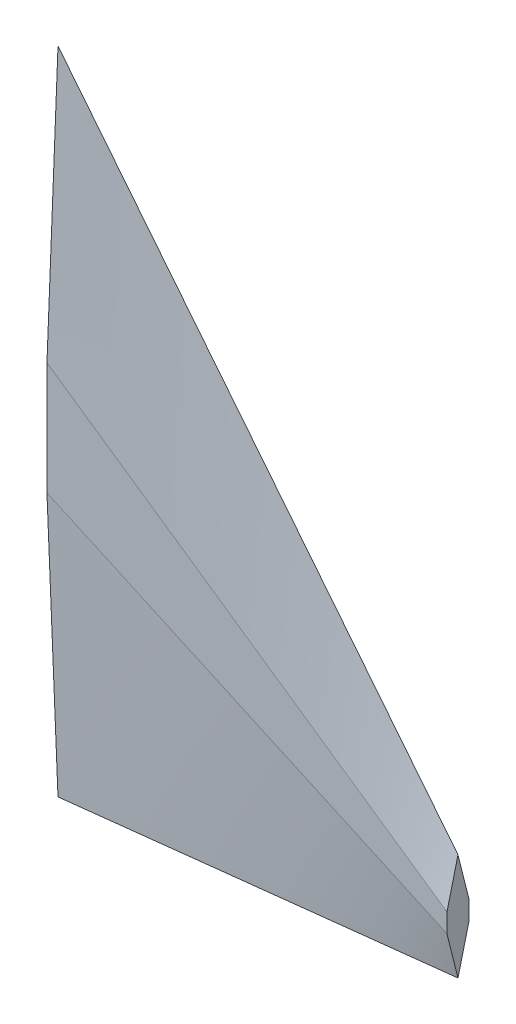
ISO-10303-21;
HEADER;
FILE_DESCRIPTION(('STEP AP214'),'2;1');
FILE_NAME('part.step','',(''),(''),'','','');
FILE_SCHEMA(('AUTOMOTIVE_DESIGN { 1 0 10303 214 1 1 1 1 }'));
ENDSEC;
DATA;
#1=APPLICATION_CONTEXT('core data for automotive mechanical design processes');
#2=APPLICATION_PROTOCOL_DEFINITION('international standard','automotive_design',2000,#1);
#3=PRODUCT_CONTEXT('',#1,'mechanical');
#4=PRODUCT('Part','Part','',(#3));
#5=PRODUCT_RELATED_PRODUCT_CATEGORY('part','',(#4));
#6=PRODUCT_DEFINITION_FORMATION('','',#4);
#7=PRODUCT_DEFINITION_CONTEXT('part definition',#1,'design');
#8=PRODUCT_DEFINITION('design','',#6,#7);
#9=PRODUCT_DEFINITION_SHAPE('','',#8);
#10=(LENGTH_UNIT() NAMED_UNIT(*) SI_UNIT(.MILLI.,.METRE.));
#11=(NAMED_UNIT(*) PLANE_ANGLE_UNIT() SI_UNIT($,.RADIAN.));
#12=(NAMED_UNIT(*) SI_UNIT($,.STERADIAN.) SOLID_ANGLE_UNIT());
#13=UNCERTAINTY_MEASURE_WITH_UNIT(LENGTH_MEASURE(1.E-05),#10,'distance_accuracy_value','');
#14=(GEOMETRIC_REPRESENTATION_CONTEXT(3) GLOBAL_UNCERTAINTY_ASSIGNED_CONTEXT((#13)) GLOBAL_UNIT_ASSIGNED_CONTEXT((#10,
#11,#12)) REPRESENTATION_CONTEXT('',''));
#15=CARTESIAN_POINT('',(0.,0.,0.));
#16=DIRECTION('',(0.,0.,1.));
#17=DIRECTION('',(1.,0.,0.));
#18=AXIS2_PLACEMENT_3D('',#15,#16,#17);
#19=CARTESIAN_POINT('',(91.39,0.,0.));
#20=DIRECTION('',(-1.,0.,0.));
#21=DIRECTION('',(0.,0.,1.));
#22=AXIS2_PLACEMENT_3D('',#19,#20,#21);
#23=PLANE('',#22);
#24=DIRECTION('',(0.,-0.969848293101963,-0.243709434300785));
#25=VECTOR('',#24,1.);
#26=CARTESIAN_POINT('',(91.39,-64.424,0.));
#27=LINE('',#26,#25);
#28=CARTESIAN_POINT('',(91.39,-54.391,2.52115384615387));
#29=VERTEX_POINT('',#28);
#30=CARTESIAN_POINT('',(91.39,-64.424,0.));
#31=VERTEX_POINT('',#30);
#32=EDGE_CURVE('E261',#29,#31,#27,.T.);
#33=ORIENTED_EDGE('',*,*,#32,.T.);
#34=DIRECTION('',(0.,0.969848293101963,-0.243709434300785));
#35=VECTOR('',#34,1.);
#36=CARTESIAN_POINT('',(91.39,-64.424,0.));
#37=LINE('',#36,#35);
#38=CARTESIAN_POINT('',(91.39,-54.391,-2.52115384615387));
#39=VERTEX_POINT('',#38);
#40=EDGE_CURVE('E12',#31,#39,#37,.T.);
#41=ORIENTED_EDGE('',*,*,#40,.T.);
#42=DIRECTION('',(0.,1.,0.));
#43=VECTOR('',#42,1.);
#44=CARTESIAN_POINT('',(91.39,-54.391,-2.52115384615387));
#45=LINE('',#44,#43);
#46=CARTESIAN_POINT('',(91.39,-50.073,-2.52115384615387));
#47=VERTEX_POINT('',#46);
#48=EDGE_CURVE('E55',#39,#47,#45,.T.);
#49=ORIENTED_EDGE('',*,*,#48,.T.);
#50=DIRECTION('',(0.,0.969848293101963,0.243709434300785));
#51=VECTOR('',#50,1.);
#52=CARTESIAN_POINT('',(91.39,-50.073,-2.52115384615387));
#53=LINE('',#52,#51);
#54=CARTESIAN_POINT('',(91.39,-40.04,0.));
#55=VERTEX_POINT('',#54);
#56=EDGE_CURVE('E295',#47,#55,#53,.T.);
#57=ORIENTED_EDGE('',*,*,#56,.T.);
#58=DIRECTION('',(0.,-0.969848293101963,0.243709434300785));
#59=VECTOR('',#58,1.);
#60=CARTESIAN_POINT('',(91.39,-50.073,2.52115384615387));
#61=LINE('',#60,#59);
#62=CARTESIAN_POINT('',(91.39,-50.073,2.52115384615387));
#63=VERTEX_POINT('',#62);
#64=EDGE_CURVE('E69',#55,#63,#61,.T.);
#65=ORIENTED_EDGE('',*,*,#64,.T.);
#66=DIRECTION('',(0.,-1.,0.));
#67=VECTOR('',#66,1.);
#68=CARTESIAN_POINT('',(91.39,-54.391,2.52115384615387));
#69=LINE('',#68,#67);
#70=EDGE_CURVE('E63',#63,#29,#69,.T.);
#71=ORIENTED_EDGE('',*,*,#70,.T.);
#72=EDGE_LOOP('',(#33,#41,#49,#57,#65,#71));
#73=FACE_BOUND('',#72,.T.);
#74=ADVANCED_FACE('F45',(#73),#23,.F.);
#75=CARTESIAN_POINT('',(0.,0.,0.));
#76=DIRECTION('',(1.,0.,0.));
#77=DIRECTION('',(0.,0.,-1.));
#78=AXIS2_PLACEMENT_3D('',#75,#76,#77);
#79=PLANE('',#78);
#80=DIRECTION('',(0.,-0.999158603528769,0.0410132295051167));
#81=VECTOR('',#80,1.);
#82=CARTESIAN_POINT('',(0.,74.29,0.));
#83=LINE('',#82,#81);
#84=CARTESIAN_POINT('',(0.,74.29,0.));
#85=VERTEX_POINT('',#84);
#86=CARTESIAN_POINT('',(0.,12.87,2.52115384615386));
#87=VERTEX_POINT('',#86);
#88=EDGE_CURVE('E106',#85,#87,#83,.T.);
#89=ORIENTED_EDGE('',*,*,#88,.F.);
#90=DIRECTION('',(0.,0.999158603528769,0.041013229505117));
#91=VECTOR('',#90,1.);
#92=CARTESIAN_POINT('',(0.,74.29,0.));
#93=LINE('',#92,#91);
#94=CARTESIAN_POINT('',(0.,12.87,-2.52115384615386));
#95=VERTEX_POINT('',#94);
#96=EDGE_CURVE('E116',#95,#85,#93,.T.);
#97=ORIENTED_EDGE('',*,*,#96,.F.);
#98=DIRECTION('',(0.,1.,0.));
#99=VECTOR('',#98,1.);
#100=CARTESIAN_POINT('',(0.,12.87,-2.52115384615386));
#101=LINE('',#100,#99);
#102=CARTESIAN_POINT('',(0.,-12.87,-2.52115384615386));
#103=VERTEX_POINT('',#102);
#104=EDGE_CURVE('E123',#103,#95,#101,.T.);
#105=ORIENTED_EDGE('',*,*,#104,.F.);
#106=DIRECTION('',(0.,0.999158603528769,-0.0410132295051168));
#107=VECTOR('',#106,1.);
#108=CARTESIAN_POINT('',(0.,-12.87,-2.52115384615386));
#109=LINE('',#108,#107);
#110=CARTESIAN_POINT('',(0.,-74.29,0.));
#111=VERTEX_POINT('',#110);
#112=EDGE_CURVE('E187',#111,#103,#109,.T.);
#113=ORIENTED_EDGE('',*,*,#112,.F.);
#114=DIRECTION('',(0.,-0.999158603528769,-0.0410132295051168));
#115=VECTOR('',#114,1.);
#116=CARTESIAN_POINT('',(0.,-12.87,2.52115384615386));
#117=LINE('',#116,#115);
#118=CARTESIAN_POINT('',(0.,-12.87,2.52115384615386));
#119=VERTEX_POINT('',#118);
#120=EDGE_CURVE('E185',#119,#111,#117,.T.);
#121=ORIENTED_EDGE('',*,*,#120,.F.);
#122=DIRECTION('',(0.,-1.,0.));
#123=VECTOR('',#122,1.);
#124=CARTESIAN_POINT('',(0.,12.87,2.52115384615386));
#125=LINE('',#124,#123);
#126=EDGE_CURVE('E129',#87,#119,#125,.T.);
#127=ORIENTED_EDGE('',*,*,#126,.F.);
#128=EDGE_LOOP('',(#89,#97,#105,#113,#121,#127));
#129=FACE_BOUND('',#128,.T.);
#130=ADVANCED_FACE('F127',(#129),#79,.F.);
#131=CARTESIAN_POINT('',(0.,12.87,-2.52115384615386));
#132=CARTESIAN_POINT('',(91.39,-50.073,-2.52115384615387));
#133=CARTESIAN_POINT('',(0.,23.1066666666667,-2.10096153846155));
#134=CARTESIAN_POINT('',(91.39,-48.4008333333334,-2.10096153846156));
#135=CARTESIAN_POINT('',(0.,33.3433333333334,-1.68076923076923));
#136=CARTESIAN_POINT('',(91.39,-46.7286666666667,-1.68076923076925));
#137=CARTESIAN_POINT('',(0.,53.8166666666667,-0.840384615384611));
#138=CARTESIAN_POINT('',(91.39,-43.3843333333334,-0.840384615384632));
#139=CARTESIAN_POINT('',(0.,64.0533333333334,-0.4201923076923));
#140=CARTESIAN_POINT('',(91.39,-41.7121666666667,-0.420192307692318));
#141=CARTESIAN_POINT('',(0.,74.29,0.));
#142=CARTESIAN_POINT('',(91.39,-40.04,0.));
#143=B_SPLINE_SURFACE_WITH_KNOTS('',3,1,((#131,#132),(#133,#134),(#135,#136),(#137,#138),(#139,
#140),(#141,#142)),.UNSPECIFIED.,.F.,.F.,.F.,(4,2,4),(2,2),(0.,0.5,1.),(0.,1.),.UNSPECIFIED.);
#144=DIRECTION('',(0.624386720645669,-0.781115371172112,0.));
#145=VECTOR('',#144,1.);
#146=CARTESIAN_POINT('',(45.695,17.125,0.));
#147=LINE('',#146,#145);
#148=EDGE_CURVE('E101',#85,#55,#147,.T.);
#149=DIRECTION('',(-0.823568875596605,0.567216278987604,0.));
#150=VECTOR('',#149,1.);
#151=CARTESIAN_POINT('',(45.695,-18.6015,-2.52115384615386));
#152=LINE('',#151,#150);
#153=EDGE_CURVE('E113',#47,#95,#152,.T.);
#154=ORIENTED_EDGE('',*,*,#96,.T.);
#155=ORIENTED_EDGE('',*,*,#148,.T.);
#156=ORIENTED_EDGE('',*,*,#56,.F.);
#157=ORIENTED_EDGE('',*,*,#153,.T.);
#158=EDGE_LOOP('',(#154,#155,#156,#157));
#159=FACE_BOUND('',#158,.T.);
#160=ADVANCED_FACE('F118',(#159),#143,.T.);
#161=CARTESIAN_POINT('',(0.,74.29,0.));
#162=CARTESIAN_POINT('',(91.39,-40.04,0.));
#163=CARTESIAN_POINT('',(0.,64.0533333333334,0.420192307692316));
#164=CARTESIAN_POINT('',(91.39,-41.7121666666663,0.420192307692219));
#165=CARTESIAN_POINT('',(0.,53.8166666666667,0.840384615384624));
#166=CARTESIAN_POINT('',(91.39,-43.3843333333328,0.840384615384485));
#167=CARTESIAN_POINT('',(0.,33.3433333333334,1.68076923076924));
#168=CARTESIAN_POINT('',(91.39,-46.7286666666661,1.68076923076911));
#169=CARTESIAN_POINT('',(0.,23.1066666666667,2.10096153846155));
#170=CARTESIAN_POINT('',(91.39,-48.400833333333,2.10096153846146));
#171=CARTESIAN_POINT('',(0.,12.87,2.52115384615386));
#172=CARTESIAN_POINT('',(91.39,-50.073,2.52115384615387));
#173=B_SPLINE_SURFACE_WITH_KNOTS('',3,1,((#161,#162),(#163,#164),(#165,#166),(#167,#168),(#169,
#170),(#171,#172)),.UNSPECIFIED.,.F.,.F.,.F.,(4,2,4),(2,2),(0.,0.5,1.),(0.,1.),.UNSPECIFIED.);
#174=DIRECTION('',(0.823568875596605,-0.567216278987604,0.));
#175=VECTOR('',#174,1.);
#176=CARTESIAN_POINT('',(45.695,-18.6015,2.52115384615386));
#177=LINE('',#176,#175);
#178=EDGE_CURVE('E112',#87,#63,#177,.T.);
#179=ORIENTED_EDGE('',*,*,#88,.T.);
#180=ORIENTED_EDGE('',*,*,#178,.T.);
#181=ORIENTED_EDGE('',*,*,#64,.F.);
#182=ORIENTED_EDGE('',*,*,#148,.F.);
#183=EDGE_LOOP('',(#179,#180,#181,#182));
#184=FACE_BOUND('',#183,.T.);
#185=ADVANCED_FACE('F103',(#184),#173,.T.);
#186=CARTESIAN_POINT('',(0.,0.,-2.52115384615386));
#187=DIRECTION('',(0.,0.,1.));
#188=DIRECTION('',(1.,0.,0.));
#189=AXIS2_PLACEMENT_3D('',#186,#187,#188);
#190=PLANE('',#189);
#191=ORIENTED_EDGE('',*,*,#153,.F.);
#192=ORIENTED_EDGE('',*,*,#48,.F.);
#193=DIRECTION('',(0.910441178771625,-0.413638562028413,0.));
#194=VECTOR('',#193,1.);
#195=CARTESIAN_POINT('',(45.695,-33.6305,-2.52115384615386));
#196=LINE('',#195,#194);
#197=EDGE_CURVE('E243',#103,#39,#196,.T.);
#198=ORIENTED_EDGE('',*,*,#197,.F.);
#199=ORIENTED_EDGE('',*,*,#104,.T.);
#200=EDGE_LOOP('',(#191,#192,#198,#199));
#201=FACE_BOUND('',#200,.T.);
#202=ADVANCED_FACE('F271',(#201),#190,.F.);
#203=CARTESIAN_POINT('',(0.,0.,2.52115384615386));
#204=DIRECTION('',(0.,0.,-1.));
#205=DIRECTION('',(-1.,0.,0.));
#206=AXIS2_PLACEMENT_3D('',#203,#204,#205);
#207=PLANE('',#206);
#208=DIRECTION('',(0.910441178771625,-0.413638562028413,0.));
#209=VECTOR('',#208,1.);
#210=CARTESIAN_POINT('',(0.,-12.87,2.52115384615386));
#211=LINE('',#210,#209);
#212=EDGE_CURVE('E244',#119,#29,#211,.T.);
#213=ORIENTED_EDGE('',*,*,#212,.T.);
#214=ORIENTED_EDGE('',*,*,#70,.F.);
#215=ORIENTED_EDGE('',*,*,#178,.F.);
#216=ORIENTED_EDGE('',*,*,#126,.T.);
#217=EDGE_LOOP('',(#213,#214,#215,#216));
#218=FACE_BOUND('',#217,.T.);
#219=ADVANCED_FACE('F217',(#218),#207,.F.);
#220=CARTESIAN_POINT('',(0.,-12.87,2.52115384615386));
#221=CARTESIAN_POINT('',(91.39,-54.391,2.52115384615387));
#222=CARTESIAN_POINT('',(0.,-23.1066666666666,2.10096153846155));
#223=CARTESIAN_POINT('',(91.39,-56.0631666666666,2.10096153846157));
#224=CARTESIAN_POINT('',(0.,-33.3433333333333,1.68076923076924));
#225=CARTESIAN_POINT('',(91.39,-57.7353333333333,1.68076923076927));
#226=CARTESIAN_POINT('',(0.,-53.8166666666666,0.840384615384623));
#227=CARTESIAN_POINT('',(91.39,-61.0796666666666,0.840384615384643));
#228=CARTESIAN_POINT('',(0.,-64.0533333333333,0.420192307692312));
#229=CARTESIAN_POINT('',(91.39,-62.7518333333333,0.420192307692325));
#230=CARTESIAN_POINT('',(0.,-74.29,0.));
#231=CARTESIAN_POINT('',(91.39,-64.424,0.));
#232=B_SPLINE_SURFACE_WITH_KNOTS('',3,1,((#220,#221),(#222,#223),(#224,#225),(#226,#227),(#228,
#229),(#230,#231)),.UNSPECIFIED.,.F.,.F.,.F.,(4,2,4),(2,2),(0.,0.5,1.),(0.,1.),.UNSPECIFIED.);
#233=DIRECTION('',(0.994223311326964,0.107331296526445,0.));
#234=VECTOR('',#233,1.);
#235=CARTESIAN_POINT('',(45.695,-69.357,0.));
#236=LINE('',#235,#234);
#237=EDGE_CURVE('E236',#111,#31,#236,.T.);
#238=ORIENTED_EDGE('',*,*,#120,.T.);
#239=ORIENTED_EDGE('',*,*,#237,.T.);
#240=ORIENTED_EDGE('',*,*,#32,.F.);
#241=ORIENTED_EDGE('',*,*,#212,.F.);
#242=EDGE_LOOP('',(#238,#239,#240,#241));
#243=FACE_BOUND('',#242,.T.);
#244=ADVANCED_FACE('F205',(#243),#232,.T.);
#245=CARTESIAN_POINT('',(0.,-74.29,0.));
#246=CARTESIAN_POINT('',(91.39,-64.424,0.));
#247=CARTESIAN_POINT('',(0.,-64.0533333333334,-0.420192307692308));
#248=CARTESIAN_POINT('',(91.39,-62.7518333333333,-0.420192307692314));
#249=CARTESIAN_POINT('',(0.,-53.8166666666667,-0.840384615384618));
#250=CARTESIAN_POINT('',(91.39,-61.0796666666666,-0.840384615384627));
#251=CARTESIAN_POINT('',(0.,-33.3433333333334,-1.68076923076924));
#252=CARTESIAN_POINT('',(91.39,-57.7353333333333,-1.68076923076925));
#253=CARTESIAN_POINT('',(0.,-23.1066666666667,-2.10096153846155));
#254=CARTESIAN_POINT('',(91.39,-56.0631666666666,-2.10096153846156));
#255=CARTESIAN_POINT('',(0.,-12.87,-2.52115384615386));
#256=CARTESIAN_POINT('',(91.39,-54.391,-2.52115384615387));
#257=B_SPLINE_SURFACE_WITH_KNOTS('',3,1,((#245,#246),(#247,#248),(#249,#250),(#251,#252),(#253,
#254),(#255,#256)),.UNSPECIFIED.,.F.,.F.,.F.,(4,2,4),(2,2),(0.,0.5,1.),(0.,1.),.UNSPECIFIED.);
#258=ORIENTED_EDGE('',*,*,#112,.T.);
#259=ORIENTED_EDGE('',*,*,#197,.T.);
#260=ORIENTED_EDGE('',*,*,#40,.F.);
#261=ORIENTED_EDGE('',*,*,#237,.F.);
#262=EDGE_LOOP('',(#258,#259,#260,#261));
#263=FACE_BOUND('',#262,.T.);
#264=ADVANCED_FACE('F216',(#263),#257,.T.);
#265=CLOSED_SHELL('',(#74,#130,#160,#185,#202,#219,#244,#264));
#266=MANIFOLD_SOLID_BREP('B2',#265);
#267=ADVANCED_BREP_SHAPE_REPRESENTATION('',(#18,#266),#14);
#268=SHAPE_DEFINITION_REPRESENTATION(#9,#267);
ENDSEC;
END-ISO-10303-21;
